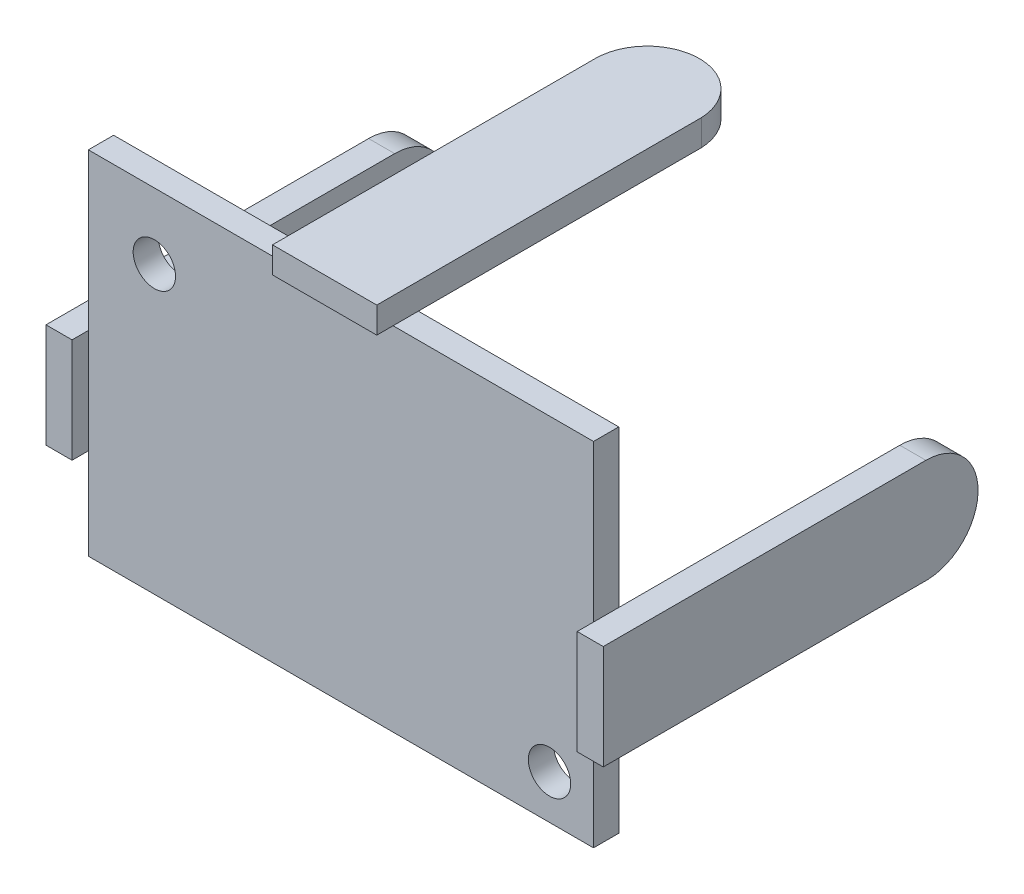
ISO-10303-21;
HEADER;
FILE_DESCRIPTION(('STEP AP214'),'2;1');
FILE_NAME('part.step','',(''),(''),'','','');
FILE_SCHEMA(('AUTOMOTIVE_DESIGN { 1 0 10303 214 1 1 1 1 }'));
ENDSEC;
DATA;
#1=APPLICATION_CONTEXT('core data for automotive mechanical design processes');
#2=APPLICATION_PROTOCOL_DEFINITION('international standard','automotive_design',2000,#1);
#3=PRODUCT_CONTEXT('',#1,'mechanical');
#4=PRODUCT('Part','Part','',(#3));
#5=PRODUCT_RELATED_PRODUCT_CATEGORY('part','',(#4));
#6=PRODUCT_DEFINITION_FORMATION('','',#4);
#7=PRODUCT_DEFINITION_CONTEXT('part definition',#1,'design');
#8=PRODUCT_DEFINITION('design','',#6,#7);
#9=PRODUCT_DEFINITION_SHAPE('','',#8);
#10=(LENGTH_UNIT() NAMED_UNIT(*) SI_UNIT(.MILLI.,.METRE.));
#11=(NAMED_UNIT(*) PLANE_ANGLE_UNIT() SI_UNIT($,.RADIAN.));
#12=(NAMED_UNIT(*) SI_UNIT($,.STERADIAN.) SOLID_ANGLE_UNIT());
#13=UNCERTAINTY_MEASURE_WITH_UNIT(LENGTH_MEASURE(1.E-05),#10,'distance_accuracy_value','');
#14=(GEOMETRIC_REPRESENTATION_CONTEXT(3) GLOBAL_UNCERTAINTY_ASSIGNED_CONTEXT((#13)) GLOBAL_UNIT_ASSIGNED_CONTEXT((#10,
#11,#12)) REPRESENTATION_CONTEXT('',''));
#15=CARTESIAN_POINT('',(0.,0.,0.));
#16=DIRECTION('',(0.,0.,1.));
#17=DIRECTION('',(1.,0.,0.));
#18=AXIS2_PLACEMENT_3D('',#15,#16,#17);
#19=CARTESIAN_POINT('',(17.1,-5.2,1.55));
#20=DIRECTION('',(0.,1.,0.));
#21=DIRECTION('',(0.,0.,1.));
#22=AXIS2_PLACEMENT_3D('',#19,#20,#21);
#23=PLANE('',#22);
#24=DIRECTION('',(0.,0.,-1.));
#25=VECTOR('',#24,1.);
#26=CARTESIAN_POINT('',(15.5,-5.2,1.55));
#27=LINE('',#26,#25);
#28=CARTESIAN_POINT('',(15.5,-5.2,2.55));
#29=VERTEX_POINT('',#28);
#30=CARTESIAN_POINT('',(15.5,-5.2,-17.364147134296));
#31=VERTEX_POINT('',#30);
#32=EDGE_CURVE('E119',#29,#31,#27,.T.);
#33=ORIENTED_EDGE('',*,*,#32,.T.);
#34=DIRECTION('',(-1.,0.,0.));
#35=VECTOR('',#34,1.);
#36=CARTESIAN_POINT('',(17.1,-5.2,-17.364147134296));
#37=LINE('',#36,#35);
#38=CARTESIAN_POINT('',(17.1,-5.2,-17.364147134296));
#39=VERTEX_POINT('',#38);
#40=EDGE_CURVE('E12',#39,#31,#37,.T.);
#41=ORIENTED_EDGE('',*,*,#40,.F.);
#42=DIRECTION('',(0.,0.,-1.));
#43=VECTOR('',#42,1.);
#44=CARTESIAN_POINT('',(17.1,-5.2,1.55));
#45=LINE('',#44,#43);
#46=CARTESIAN_POINT('',(17.1,-5.2,2.55));
#47=VERTEX_POINT('',#46);
#48=EDGE_CURVE('E98',#47,#39,#45,.T.);
#49=ORIENTED_EDGE('',*,*,#48,.F.);
#50=DIRECTION('',(-1.,0.,0.));
#51=VECTOR('',#50,1.);
#52=CARTESIAN_POINT('',(17.1,-5.2,2.55));
#53=LINE('',#52,#51);
#54=EDGE_CURVE('E118',#47,#29,#53,.T.);
#55=ORIENTED_EDGE('',*,*,#54,.T.);
#56=EDGE_LOOP('',(#33,#41,#49,#55));
#57=FACE_BOUND('',#56,.T.);
#58=ADVANCED_FACE('F56',(#57),#23,.F.);
#59=CARTESIAN_POINT('',(17.1,-2.00103650553792,-17.2489634944621));
#60=DIRECTION('',(-1.,0.,0.));
#61=DIRECTION('',(0.,0.,1.));
#62=AXIS2_PLACEMENT_3D('',#59,#60,#61);
#63=CYLINDRICAL_SURFACE('',#62,3.20103650553792);
#64=CARTESIAN_POINT('',(15.5,-2.00103650553792,-17.2489634944621));
#65=DIRECTION('',(-1.,0.,0.));
#66=DIRECTION('',(0.,-1.,0.));
#67=AXIS2_PLACEMENT_3D('',#64,#65,#66);
#68=CIRCLE('',#67,3.20103650553792);
#69=CARTESIAN_POINT('',(15.5,1.2,-17.2489634944621));
#70=VERTEX_POINT('',#69);
#71=EDGE_CURVE('E108',#70,#31,#68,.T.);
#72=ORIENTED_EDGE('',*,*,#71,.F.);
#73=DIRECTION('',(-1.,0.,0.));
#74=VECTOR('',#73,1.);
#75=CARTESIAN_POINT('',(17.1,1.2,-17.2489634944621));
#76=LINE('',#75,#74);
#77=CARTESIAN_POINT('',(17.1,1.2,-17.2489634944621));
#78=VERTEX_POINT('',#77);
#79=EDGE_CURVE('E64',#78,#70,#76,.T.);
#80=ORIENTED_EDGE('',*,*,#79,.F.);
#81=CARTESIAN_POINT('',(17.1,-2.00103650553792,-17.2489634944621));
#82=DIRECTION('',(-1.,0.,0.));
#83=DIRECTION('',(0.,-1.,0.));
#84=AXIS2_PLACEMENT_3D('',#81,#82,#83);
#85=CIRCLE('',#84,3.20103650553792);
#86=EDGE_CURVE('E106',#78,#39,#85,.T.);
#87=ORIENTED_EDGE('',*,*,#86,.T.);
#88=ORIENTED_EDGE('',*,*,#40,.T.);
#89=EDGE_LOOP('',(#72,#80,#87,#88));
#90=FACE_BOUND('',#89,.T.);
#91=ADVANCED_FACE('F105',(#90),#63,.T.);
#92=CARTESIAN_POINT('',(17.1,1.2,1.55));
#93=DIRECTION('',(0.,-1.,0.));
#94=DIRECTION('',(0.,0.,-1.));
#95=AXIS2_PLACEMENT_3D('',#92,#93,#94);
#96=PLANE('',#95);
#97=DIRECTION('',(0.,0.,1.));
#98=VECTOR('',#97,1.);
#99=CARTESIAN_POINT('',(15.5,1.2,1.55));
#100=LINE('',#99,#98);
#101=CARTESIAN_POINT('',(15.5,1.2,2.55));
#102=VERTEX_POINT('',#101);
#103=EDGE_CURVE('E87',#70,#102,#100,.T.);
#104=ORIENTED_EDGE('',*,*,#103,.T.);
#105=DIRECTION('',(-1.,0.,0.));
#106=VECTOR('',#105,1.);
#107=CARTESIAN_POINT('',(17.1,1.2,2.55));
#108=LINE('',#107,#106);
#109=CARTESIAN_POINT('',(17.1,1.2,2.55));
#110=VERTEX_POINT('',#109);
#111=EDGE_CURVE('E109',#110,#102,#108,.T.);
#112=ORIENTED_EDGE('',*,*,#111,.F.);
#113=DIRECTION('',(0.,0.,1.));
#114=VECTOR('',#113,1.);
#115=CARTESIAN_POINT('',(17.1,1.2,1.55));
#116=LINE('',#115,#114);
#117=EDGE_CURVE('E110',#78,#110,#116,.T.);
#118=ORIENTED_EDGE('',*,*,#117,.F.);
#119=ORIENTED_EDGE('',*,*,#79,.T.);
#120=EDGE_LOOP('',(#104,#112,#118,#119));
#121=FACE_BOUND('',#120,.T.);
#122=ADVANCED_FACE('F111',(#121),#96,.F.);
#123=CARTESIAN_POINT('',(17.1,10.8,2.55));
#124=DIRECTION('',(0.,0.,-1.));
#125=DIRECTION('',(0.,1.,0.));
#126=AXIS2_PLACEMENT_3D('',#123,#124,#125);
#127=PLANE('',#126);
#128=DIRECTION('',(0.,-1.,0.));
#129=VECTOR('',#128,1.);
#130=CARTESIAN_POINT('',(15.5,10.8,2.55));
#131=LINE('',#130,#129);
#132=EDGE_CURVE('E93',#102,#29,#131,.T.);
#133=ORIENTED_EDGE('',*,*,#132,.T.);
#134=ORIENTED_EDGE('',*,*,#54,.F.);
#135=DIRECTION('',(0.,-1.,0.));
#136=VECTOR('',#135,1.);
#137=CARTESIAN_POINT('',(17.1,10.8,2.55));
#138=LINE('',#137,#136);
#139=EDGE_CURVE('E72',#110,#47,#138,.T.);
#140=ORIENTED_EDGE('',*,*,#139,.F.);
#141=ORIENTED_EDGE('',*,*,#111,.T.);
#142=EDGE_LOOP('',(#133,#134,#140,#141));
#143=FACE_BOUND('',#142,.T.);
#144=ADVANCED_FACE('F126',(#143),#127,.F.);
#145=CARTESIAN_POINT('',(17.1,-2.00103650553792,-17.2489634944621));
#146=DIRECTION('',(-1.,0.,0.));
#147=DIRECTION('',(0.,-1.,0.));
#148=AXIS2_PLACEMENT_3D('',#145,#146,#147);
#149=PLANE('',#148);
#150=ORIENTED_EDGE('',*,*,#48,.T.);
#151=ORIENTED_EDGE('',*,*,#86,.F.);
#152=ORIENTED_EDGE('',*,*,#117,.T.);
#153=ORIENTED_EDGE('',*,*,#139,.T.);
#154=EDGE_LOOP('',(#150,#151,#152,#153));
#155=FACE_BOUND('',#154,.T.);
#156=ADVANCED_FACE('F113',(#155),#149,.F.);
#157=CARTESIAN_POINT('',(15.5,-2.00103650553792,-17.2489634944621));
#158=DIRECTION('',(-1.,0.,0.));
#159=DIRECTION('',(0.,-1.,0.));
#160=AXIS2_PLACEMENT_3D('',#157,#158,#159);
#161=PLANE('',#160);
#162=ORIENTED_EDGE('',*,*,#32,.F.);
#163=ORIENTED_EDGE('',*,*,#132,.F.);
#164=ORIENTED_EDGE('',*,*,#103,.F.);
#165=ORIENTED_EDGE('',*,*,#71,.T.);
#166=EDGE_LOOP('',(#162,#163,#164,#165));
#167=FACE_BOUND('',#166,.T.);
#168=ADVANCED_FACE('F129',(#167),#161,.T.);
#169=CLOSED_SHELL('',(#58,#91,#122,#144,#156,#168));
#170=MANIFOLD_SOLID_BREP('B2',#169);
#171=CARTESIAN_POINT('',(15.5,10.8,1.55));
#172=DIRECTION('',(0.,-1.,0.));
#173=DIRECTION('',(1.,0.,0.));
#174=AXIS2_PLACEMENT_3D('',#171,#172,#173);
#175=PLANE('',#174);
#176=DIRECTION('',(0.,0.,1.));
#177=VECTOR('',#176,1.);
#178=CARTESIAN_POINT('',(-3.2,10.8,2.55));
#179=LINE('',#178,#177);
#180=CARTESIAN_POINT('',(-3.2,10.8,0.));
#181=VERTEX_POINT('',#180);
#182=CARTESIAN_POINT('',(-3.2,10.8,1.55));
#183=VERTEX_POINT('',#182);
#184=EDGE_CURVE('E54',#181,#183,#179,.T.);
#185=ORIENTED_EDGE('',*,*,#184,.F.);
#186=DIRECTION('',(-1.,0.,0.));
#187=VECTOR('',#186,1.);
#188=CARTESIAN_POINT('',(15.5,10.8,0.));
#189=LINE('',#188,#187);
#190=CARTESIAN_POINT('',(-15.5,10.8,0.));
#191=VERTEX_POINT('',#190);
#192=EDGE_CURVE('E451',#181,#191,#189,.T.);
#193=ORIENTED_EDGE('',*,*,#192,.T.);
#194=DIRECTION('',(0.,0.,-1.));
#195=VECTOR('',#194,1.);
#196=CARTESIAN_POINT('',(-15.5,10.8,1.55));
#197=LINE('',#196,#195);
#198=CARTESIAN_POINT('',(-15.5,10.8,1.55));
#199=VERTEX_POINT('',#198);
#200=EDGE_CURVE('E438',#199,#191,#197,.T.);
#201=ORIENTED_EDGE('',*,*,#200,.F.);
#202=DIRECTION('',(-1.,0.,0.));
#203=VECTOR('',#202,1.);
#204=CARTESIAN_POINT('',(15.5,10.8,1.55));
#205=LINE('',#204,#203);
#206=EDGE_CURVE('E223',#183,#199,#205,.T.);
#207=ORIENTED_EDGE('',*,*,#206,.F.);
#208=EDGE_LOOP('',(#185,#193,#201,#207));
#209=FACE_BOUND('',#208,.T.);
#210=ADVANCED_FACE('F203',(#209),#175,.F.);
#211=DIRECTION('',(0.,0.,-1.));
#212=VECTOR('',#211,1.);
#213=CARTESIAN_POINT('',(3.2,10.8,2.55));
#214=LINE('',#213,#212);
#215=CARTESIAN_POINT('',(3.2,10.8,1.55));
#216=VERTEX_POINT('',#215);
#217=CARTESIAN_POINT('',(3.2,10.8,0.));
#218=VERTEX_POINT('',#217);
#219=EDGE_CURVE('E213',#216,#218,#214,.T.);
#220=ORIENTED_EDGE('',*,*,#219,.F.);
#221=CARTESIAN_POINT('',(15.5,10.8,1.55));
#222=VERTEX_POINT('',#221);
#223=EDGE_CURVE('E435',#222,#216,#205,.T.);
#224=ORIENTED_EDGE('',*,*,#223,.F.);
#225=DIRECTION('',(0.,0.,-1.));
#226=VECTOR('',#225,1.);
#227=CARTESIAN_POINT('',(15.5,10.8,1.55));
#228=LINE('',#227,#226);
#229=CARTESIAN_POINT('',(15.5,10.8,0.));
#230=VERTEX_POINT('',#229);
#231=EDGE_CURVE('E459',#222,#230,#228,.T.);
#232=ORIENTED_EDGE('',*,*,#231,.T.);
#233=EDGE_CURVE('E452',#230,#218,#189,.T.);
#234=ORIENTED_EDGE('',*,*,#233,.T.);
#235=EDGE_LOOP('',(#220,#224,#232,#234));
#236=FACE_BOUND('',#235,.T.);
#237=ADVANCED_FACE('F564',(#236),#175,.F.);
#238=CARTESIAN_POINT('',(-15.5,10.8,1.55));
#239=DIRECTION('',(1.,0.,0.));
#240=DIRECTION('',(0.,1.,0.));
#241=AXIS2_PLACEMENT_3D('',#238,#239,#240);
#242=PLANE('',#241);
#243=DIRECTION('',(0.,-1.,0.));
#244=VECTOR('',#243,1.);
#245=CARTESIAN_POINT('',(-15.5,10.8,1.55));
#246=LINE('',#245,#244);
#247=CARTESIAN_POINT('',(-15.5,-5.2,1.55));
#248=VERTEX_POINT('',#247);
#249=CARTESIAN_POINT('',(-15.5,-10.8,1.55));
#250=VERTEX_POINT('',#249);
#251=EDGE_CURVE('E429',#248,#250,#246,.T.);
#252=ORIENTED_EDGE('',*,*,#251,.F.);
#253=DIRECTION('',(0.,0.,-1.));
#254=VECTOR('',#253,1.);
#255=CARTESIAN_POINT('',(-15.5,-5.2,1.55));
#256=LINE('',#255,#254);
#257=CARTESIAN_POINT('',(-15.5,-5.2,0.));
#258=VERTEX_POINT('',#257);
#259=EDGE_CURVE('E355',#248,#258,#256,.T.);
#260=ORIENTED_EDGE('',*,*,#259,.T.);
#261=DIRECTION('',(0.,-1.,0.));
#262=VECTOR('',#261,1.);
#263=CARTESIAN_POINT('',(-15.5,10.8,0.));
#264=LINE('',#263,#262);
#265=CARTESIAN_POINT('',(-15.5,-10.8,0.));
#266=VERTEX_POINT('',#265);
#267=EDGE_CURVE('E419',#258,#266,#264,.T.);
#268=ORIENTED_EDGE('',*,*,#267,.T.);
#269=DIRECTION('',(0.,0.,-1.));
#270=VECTOR('',#269,1.);
#271=CARTESIAN_POINT('',(-15.5,-10.8,1.55));
#272=LINE('',#271,#270);
#273=EDGE_CURVE('E207',#250,#266,#272,.T.);
#274=ORIENTED_EDGE('',*,*,#273,.F.);
#275=EDGE_LOOP('',(#252,#260,#268,#274));
#276=FACE_BOUND('',#275,.T.);
#277=ADVANCED_FACE('F500',(#276),#242,.F.);
#278=CARTESIAN_POINT('',(0.,0.,1.55));
#279=DIRECTION('',(0.,0.,-1.));
#280=DIRECTION('',(-1.,0.,0.));
#281=AXIS2_PLACEMENT_3D('',#278,#279,#280);
#282=PLANE('',#281);
#283=CARTESIAN_POINT('',(-15.5,1.2,1.55));
#284=VERTEX_POINT('',#283);
#285=EDGE_CURVE('E423',#199,#284,#246,.T.);
#286=ORIENTED_EDGE('',*,*,#285,.T.);
#287=EDGE_CURVE('E428',#284,#248,#246,.T.);
#288=ORIENTED_EDGE('',*,*,#287,.T.);
#289=ORIENTED_EDGE('',*,*,#251,.T.);
#290=DIRECTION('',(1.,0.,0.));
#291=VECTOR('',#290,1.);
#292=CARTESIAN_POINT('',(15.5,-10.8,1.55));
#293=LINE('',#292,#291);
#294=CARTESIAN_POINT('',(15.5,-10.8,1.55));
#295=VERTEX_POINT('',#294);
#296=EDGE_CURVE('E427',#250,#295,#293,.T.);
#297=ORIENTED_EDGE('',*,*,#296,.T.);
#298=DIRECTION('',(0.,1.,0.));
#299=VECTOR('',#298,1.);
#300=CARTESIAN_POINT('',(15.5,10.8,1.55));
#301=LINE('',#300,#299);
#302=EDGE_CURVE('E432',#295,#222,#301,.T.);
#303=ORIENTED_EDGE('',*,*,#302,.T.);
#304=ORIENTED_EDGE('',*,*,#223,.T.);
#305=EDGE_CURVE('E439',#216,#183,#205,.T.);
#306=ORIENTED_EDGE('',*,*,#305,.T.);
#307=ORIENTED_EDGE('',*,*,#206,.T.);
#308=EDGE_LOOP('',(#286,#288,#289,#297,#303,#304,#306,#307));
#309=FACE_BOUND('',#308,.T.);
#310=CARTESIAN_POINT('',(12.8,-8.1,1.55));
#311=DIRECTION('',(0.,0.,1.));
#312=DIRECTION('',(1.,0.,0.));
#313=AXIS2_PLACEMENT_3D('',#310,#311,#312);
#314=CIRCLE('',#313,1.3);
#315=CARTESIAN_POINT('',(14.1,-8.1,1.55));
#316=VERTEX_POINT('',#315);
#317=EDGE_CURVE('E415',#316,#316,#314,.T.);
#318=ORIENTED_EDGE('',*,*,#317,.F.);
#319=EDGE_LOOP('',(#318));
#320=FACE_BOUND('',#319,.T.);
#321=CARTESIAN_POINT('',(-11.45,6.75,1.55));
#322=DIRECTION('',(0.,0.,1.));
#323=DIRECTION('',(1.,0.,0.));
#324=AXIS2_PLACEMENT_3D('',#321,#322,#323);
#325=CIRCLE('',#324,1.3);
#326=CARTESIAN_POINT('',(-10.15,6.75,1.55));
#327=VERTEX_POINT('',#326);
#328=EDGE_CURVE('E407',#327,#327,#325,.T.);
#329=ORIENTED_EDGE('',*,*,#328,.F.);
#330=EDGE_LOOP('',(#329));
#331=FACE_BOUND('',#330,.T.);
#332=ADVANCED_FACE('F504',(#309,#320,#331),#282,.F.);
#333=CARTESIAN_POINT('',(0.,0.,0.));
#334=DIRECTION('',(0.,0.,-1.));
#335=DIRECTION('',(-1.,0.,0.));
#336=AXIS2_PLACEMENT_3D('',#333,#334,#335);
#337=PLANE('',#336);
#338=CARTESIAN_POINT('',(12.8,-8.1,0.));
#339=DIRECTION('',(0.,0.,1.));
#340=DIRECTION('',(1.,0.,0.));
#341=AXIS2_PLACEMENT_3D('',#338,#339,#340);
#342=CIRCLE('',#341,1.3);
#343=CARTESIAN_POINT('',(14.1,-8.1,0.));
#344=VERTEX_POINT('',#343);
#345=EDGE_CURVE('E411',#344,#344,#342,.T.);
#346=ORIENTED_EDGE('',*,*,#345,.T.);
#347=EDGE_LOOP('',(#346));
#348=FACE_BOUND('',#347,.T.);
#349=CARTESIAN_POINT('',(-15.5,1.2,0.));
#350=VERTEX_POINT('',#349);
#351=EDGE_CURVE('E440',#191,#350,#264,.T.);
#352=ORIENTED_EDGE('',*,*,#351,.F.);
#353=ORIENTED_EDGE('',*,*,#192,.F.);
#354=EDGE_CURVE('E455',#218,#181,#189,.T.);
#355=ORIENTED_EDGE('',*,*,#354,.F.);
#356=ORIENTED_EDGE('',*,*,#233,.F.);
#357=DIRECTION('',(0.,1.,0.));
#358=VECTOR('',#357,1.);
#359=CARTESIAN_POINT('',(15.5,10.8,0.));
#360=LINE('',#359,#358);
#361=CARTESIAN_POINT('',(15.5,-10.8,0.));
#362=VERTEX_POINT('',#361);
#363=EDGE_CURVE('E448',#362,#230,#360,.T.);
#364=ORIENTED_EDGE('',*,*,#363,.F.);
#365=DIRECTION('',(1.,0.,0.));
#366=VECTOR('',#365,1.);
#367=CARTESIAN_POINT('',(15.5,-10.8,0.));
#368=LINE('',#367,#366);
#369=EDGE_CURVE('E444',#266,#362,#368,.T.);
#370=ORIENTED_EDGE('',*,*,#369,.F.);
#371=ORIENTED_EDGE('',*,*,#267,.F.);
#372=EDGE_CURVE('E445',#350,#258,#264,.T.);
#373=ORIENTED_EDGE('',*,*,#372,.F.);
#374=EDGE_LOOP('',(#352,#353,#355,#356,#364,#370,#371,#373));
#375=FACE_BOUND('',#374,.T.);
#376=CARTESIAN_POINT('',(-11.45,6.75,0.));
#377=DIRECTION('',(0.,0.,1.));
#378=DIRECTION('',(1.,0.,0.));
#379=AXIS2_PLACEMENT_3D('',#376,#377,#378);
#380=CIRCLE('',#379,1.3);
#381=CARTESIAN_POINT('',(-10.15,6.75,0.));
#382=VERTEX_POINT('',#381);
#383=EDGE_CURVE('E396',#382,#382,#380,.T.);
#384=ORIENTED_EDGE('',*,*,#383,.T.);
#385=EDGE_LOOP('',(#384));
#386=FACE_BOUND('',#385,.T.);
#387=ADVANCED_FACE('F516',(#348,#375,#386),#337,.T.);
#388=ORIENTED_EDGE('',*,*,#351,.T.);
#389=DIRECTION('',(0.,0.,1.));
#390=VECTOR('',#389,1.);
#391=CARTESIAN_POINT('',(-15.5,1.2,1.55));
#392=LINE('',#391,#390);
#393=EDGE_CURVE('E389',#350,#284,#392,.T.);
#394=ORIENTED_EDGE('',*,*,#393,.T.);
#395=ORIENTED_EDGE('',*,*,#285,.F.);
#396=ORIENTED_EDGE('',*,*,#200,.T.);
#397=EDGE_LOOP('',(#388,#394,#395,#396));
#398=FACE_BOUND('',#397,.T.);
#399=ADVANCED_FACE('F205',(#398),#242,.F.);
#400=CARTESIAN_POINT('',(15.5,-10.8,1.55));
#401=DIRECTION('',(0.,1.,0.));
#402=DIRECTION('',(-1.,0.,0.));
#403=AXIS2_PLACEMENT_3D('',#400,#401,#402);
#404=PLANE('',#403);
#405=ORIENTED_EDGE('',*,*,#369,.T.);
#406=DIRECTION('',(0.,0.,-1.));
#407=VECTOR('',#406,1.);
#408=CARTESIAN_POINT('',(15.5,-10.8,1.55));
#409=LINE('',#408,#407);
#410=EDGE_CURVE('E462',#295,#362,#409,.T.);
#411=ORIENTED_EDGE('',*,*,#410,.F.);
#412=ORIENTED_EDGE('',*,*,#296,.F.);
#413=ORIENTED_EDGE('',*,*,#273,.T.);
#414=EDGE_LOOP('',(#405,#411,#412,#413));
#415=FACE_BOUND('',#414,.T.);
#416=ADVANCED_FACE('F519',(#415),#404,.F.);
#417=CARTESIAN_POINT('',(15.5,10.8,1.55));
#418=DIRECTION('',(-1.,0.,0.));
#419=DIRECTION('',(0.,-1.,0.));
#420=AXIS2_PLACEMENT_3D('',#417,#418,#419);
#421=PLANE('',#420);
#422=ORIENTED_EDGE('',*,*,#363,.T.);
#423=ORIENTED_EDGE('',*,*,#231,.F.);
#424=ORIENTED_EDGE('',*,*,#302,.F.);
#425=ORIENTED_EDGE('',*,*,#410,.T.);
#426=EDGE_LOOP('',(#422,#423,#424,#425));
#427=FACE_BOUND('',#426,.T.);
#428=ADVANCED_FACE('F521',(#427),#421,.F.);
#429=CARTESIAN_POINT('',(12.8,-8.1,1.55));
#430=DIRECTION('',(0.,0.,-1.));
#431=DIRECTION('',(-1.,0.,0.));
#432=AXIS2_PLACEMENT_3D('',#429,#430,#431);
#433=CYLINDRICAL_SURFACE('',#432,1.3);
#434=ORIENTED_EDGE('',*,*,#317,.T.);
#435=EDGE_LOOP('',(#434));
#436=FACE_BOUND('',#435,.T.);
#437=ORIENTED_EDGE('',*,*,#345,.F.);
#438=EDGE_LOOP('',(#437));
#439=FACE_BOUND('',#438,.T.);
#440=ADVANCED_FACE('F573',(#436,#439),#433,.F.);
#441=CARTESIAN_POINT('',(-11.45,6.75,1.55));
#442=DIRECTION('',(0.,0.,-1.));
#443=DIRECTION('',(-1.,0.,0.));
#444=AXIS2_PLACEMENT_3D('',#441,#442,#443);
#445=CYLINDRICAL_SURFACE('',#444,1.3);
#446=ORIENTED_EDGE('',*,*,#328,.T.);
#447=EDGE_LOOP('',(#446));
#448=FACE_BOUND('',#447,.T.);
#449=ORIENTED_EDGE('',*,*,#383,.F.);
#450=EDGE_LOOP('',(#449));
#451=FACE_BOUND('',#450,.T.);
#452=ADVANCED_FACE('F577',(#448,#451),#445,.F.);
#453=CARTESIAN_POINT('',(-15.5,-2.00103650553792,-17.2489634944621));
#454=DIRECTION('',(1.,0.,0.));
#455=DIRECTION('',(0.,1.,0.));
#456=AXIS2_PLACEMENT_3D('',#453,#454,#455);
#457=PLANE('',#456);
#458=ORIENTED_EDGE('',*,*,#287,.F.);
#459=CARTESIAN_POINT('',(-15.5,1.2,2.55));
#460=VERTEX_POINT('',#459);
#461=EDGE_CURVE('E384',#284,#460,#392,.T.);
#462=ORIENTED_EDGE('',*,*,#461,.T.);
#463=DIRECTION('',(0.,-1.,0.));
#464=VECTOR('',#463,1.);
#465=CARTESIAN_POINT('',(-15.5,10.8,2.55));
#466=LINE('',#465,#464);
#467=CARTESIAN_POINT('',(-15.5,-5.2,2.55));
#468=VERTEX_POINT('',#467);
#469=EDGE_CURVE('E365',#460,#468,#466,.T.);
#470=ORIENTED_EDGE('',*,*,#469,.T.);
#471=EDGE_CURVE('E353',#468,#248,#256,.T.);
#472=ORIENTED_EDGE('',*,*,#471,.T.);
#473=EDGE_LOOP('',(#458,#462,#470,#472));
#474=FACE_BOUND('',#473,.T.);
#475=ADVANCED_FACE('F483',(#474),#457,.T.);
#476=CARTESIAN_POINT('',(-17.1,-5.2,1.55));
#477=DIRECTION('',(0.,-1.,0.));
#478=DIRECTION('',(0.,0.,-1.));
#479=AXIS2_PLACEMENT_3D('',#476,#477,#478);
#480=PLANE('',#479);
#481=ORIENTED_EDGE('',*,*,#471,.F.);
#482=DIRECTION('',(1.,0.,0.));
#483=VECTOR('',#482,1.);
#484=CARTESIAN_POINT('',(-17.1,-5.2,2.55));
#485=LINE('',#484,#483);
#486=CARTESIAN_POINT('',(-17.1,-5.2,2.55));
#487=VERTEX_POINT('',#486);
#488=EDGE_CURVE('E393',#487,#468,#485,.T.);
#489=ORIENTED_EDGE('',*,*,#488,.F.);
#490=DIRECTION('',(0.,0.,-1.));
#491=VECTOR('',#490,1.);
#492=CARTESIAN_POINT('',(-17.1,-5.2,1.55));
#493=LINE('',#492,#491);
#494=CARTESIAN_POINT('',(-17.1,-5.2,-17.364147134296));
#495=VERTEX_POINT('',#494);
#496=EDGE_CURVE('E360',#487,#495,#493,.T.);
#497=ORIENTED_EDGE('',*,*,#496,.T.);
#498=DIRECTION('',(1.,0.,0.));
#499=VECTOR('',#498,1.);
#500=CARTESIAN_POINT('',(-17.1,-5.2,-17.364147134296));
#501=LINE('',#500,#499);
#502=CARTESIAN_POINT('',(-15.5,-5.2,-17.364147134296));
#503=VERTEX_POINT('',#502);
#504=EDGE_CURVE('E376',#495,#503,#501,.T.);
#505=ORIENTED_EDGE('',*,*,#504,.T.);
#506=EDGE_CURVE('E349',#258,#503,#256,.T.);
#507=ORIENTED_EDGE('',*,*,#506,.F.);
#508=ORIENTED_EDGE('',*,*,#259,.F.);
#509=EDGE_LOOP('',(#481,#489,#497,#505,#507,#508));
#510=FACE_BOUND('',#509,.T.);
#511=ADVANCED_FACE('F496',(#510),#480,.T.);
#512=CARTESIAN_POINT('',(-17.1,10.8,2.55));
#513=DIRECTION('',(0.,0.,1.));
#514=DIRECTION('',(0.,-1.,0.));
#515=AXIS2_PLACEMENT_3D('',#512,#513,#514);
#516=PLANE('',#515);
#517=ORIENTED_EDGE('',*,*,#469,.F.);
#518=DIRECTION('',(1.,0.,0.));
#519=VECTOR('',#518,1.);
#520=CARTESIAN_POINT('',(-17.1,1.2,2.55));
#521=LINE('',#520,#519);
#522=CARTESIAN_POINT('',(-17.1,1.2,2.55));
#523=VERTEX_POINT('',#522);
#524=EDGE_CURVE('E397',#523,#460,#521,.T.);
#525=ORIENTED_EDGE('',*,*,#524,.F.);
#526=DIRECTION('',(0.,-1.,0.));
#527=VECTOR('',#526,1.);
#528=CARTESIAN_POINT('',(-17.1,10.8,2.55));
#529=LINE('',#528,#527);
#530=EDGE_CURVE('E373',#523,#487,#529,.T.);
#531=ORIENTED_EDGE('',*,*,#530,.T.);
#532=ORIENTED_EDGE('',*,*,#488,.T.);
#533=EDGE_LOOP('',(#517,#525,#531,#532));
#534=FACE_BOUND('',#533,.T.);
#535=ADVANCED_FACE('F492',(#534),#516,.T.);
#536=CARTESIAN_POINT('',(-17.1,1.2,1.55));
#537=DIRECTION('',(0.,1.,0.));
#538=DIRECTION('',(0.,0.,1.));
#539=AXIS2_PLACEMENT_3D('',#536,#537,#538);
#540=PLANE('',#539);
#541=CARTESIAN_POINT('',(-15.5,1.2,-17.2489634944621));
#542=VERTEX_POINT('',#541);
#543=EDGE_CURVE('E385',#542,#350,#392,.T.);
#544=ORIENTED_EDGE('',*,*,#543,.F.);
#545=DIRECTION('',(1.,0.,0.));
#546=VECTOR('',#545,1.);
#547=CARTESIAN_POINT('',(-17.1,1.2,-17.2489634944621));
#548=LINE('',#547,#546);
#549=CARTESIAN_POINT('',(-17.1,1.2,-17.2489634944621));
#550=VERTEX_POINT('',#549);
#551=EDGE_CURVE('E401',#550,#542,#548,.T.);
#552=ORIENTED_EDGE('',*,*,#551,.F.);
#553=DIRECTION('',(0.,0.,1.));
#554=VECTOR('',#553,1.);
#555=CARTESIAN_POINT('',(-17.1,1.2,1.55));
#556=LINE('',#555,#554);
#557=EDGE_CURVE('E369',#550,#523,#556,.T.);
#558=ORIENTED_EDGE('',*,*,#557,.T.);
#559=ORIENTED_EDGE('',*,*,#524,.T.);
#560=ORIENTED_EDGE('',*,*,#461,.F.);
#561=ORIENTED_EDGE('',*,*,#393,.F.);
#562=EDGE_LOOP('',(#544,#552,#558,#559,#560,#561));
#563=FACE_BOUND('',#562,.T.);
#564=ADVANCED_FACE('F488',(#563),#540,.T.);
#565=CARTESIAN_POINT('',(-17.1,-2.00103650553792,-17.2489634944621));
#566=DIRECTION('',(1.,0.,0.));
#567=DIRECTION('',(0.,0.,-1.));
#568=AXIS2_PLACEMENT_3D('',#565,#566,#567);
#569=CYLINDRICAL_SURFACE('',#568,3.20103650553792);
#570=CARTESIAN_POINT('',(-15.5,-2.00103650553792,-17.2489634944621));
#571=DIRECTION('',(1.,0.,0.));
#572=DIRECTION('',(0.,1.,0.));
#573=AXIS2_PLACEMENT_3D('',#570,#571,#572);
#574=CIRCLE('',#573,3.20103650553792);
#575=EDGE_CURVE('E380',#503,#542,#574,.T.);
#576=ORIENTED_EDGE('',*,*,#575,.F.);
#577=ORIENTED_EDGE('',*,*,#504,.F.);
#578=CARTESIAN_POINT('',(-17.1,-2.00103650553792,-17.2489634944621));
#579=DIRECTION('',(1.,0.,0.));
#580=DIRECTION('',(0.,1.,0.));
#581=AXIS2_PLACEMENT_3D('',#578,#579,#580);
#582=CIRCLE('',#581,3.20103650553792);
#583=EDGE_CURVE('E364',#495,#550,#582,.T.);
#584=ORIENTED_EDGE('',*,*,#583,.T.);
#585=ORIENTED_EDGE('',*,*,#551,.T.);
#586=EDGE_LOOP('',(#576,#577,#584,#585));
#587=FACE_BOUND('',#586,.T.);
#588=ADVANCED_FACE('F655',(#587),#569,.T.);
#589=CARTESIAN_POINT('',(-17.1,-2.00103650553792,-17.2489634944621));
#590=DIRECTION('',(1.,0.,0.));
#591=DIRECTION('',(0.,1.,0.));
#592=AXIS2_PLACEMENT_3D('',#589,#590,#591);
#593=PLANE('',#592);
#594=ORIENTED_EDGE('',*,*,#496,.F.);
#595=ORIENTED_EDGE('',*,*,#530,.F.);
#596=ORIENTED_EDGE('',*,*,#557,.F.);
#597=ORIENTED_EDGE('',*,*,#583,.F.);
#598=EDGE_LOOP('',(#594,#595,#596,#597));
#599=FACE_BOUND('',#598,.T.);
#600=ADVANCED_FACE('F664',(#599),#593,.F.);
#601=ORIENTED_EDGE('',*,*,#543,.T.);
#602=ORIENTED_EDGE('',*,*,#372,.T.);
#603=ORIENTED_EDGE('',*,*,#506,.T.);
#604=ORIENTED_EDGE('',*,*,#575,.T.);
#605=EDGE_LOOP('',(#601,#602,#603,#604));
#606=FACE_BOUND('',#605,.T.);
#607=ADVANCED_FACE('F632',(#606),#457,.T.);
#608=CARTESIAN_POINT('',(0.00103650553792742,10.8,-17.2489634944621));
#609=DIRECTION('',(0.,-1.,0.));
#610=DIRECTION('',(1.,0.,0.));
#611=AXIS2_PLACEMENT_3D('',#608,#609,#610);
#612=PLANE('',#611);
#613=ORIENTED_EDGE('',*,*,#305,.F.);
#614=CARTESIAN_POINT('',(3.2,10.8,2.55));
#615=VERTEX_POINT('',#614);
#616=EDGE_CURVE('E526',#615,#216,#214,.T.);
#617=ORIENTED_EDGE('',*,*,#616,.F.);
#618=DIRECTION('',(1.,0.,0.));
#619=VECTOR('',#618,1.);
#620=CARTESIAN_POINT('',(-3.2,10.8,2.55));
#621=LINE('',#620,#619);
#622=CARTESIAN_POINT('',(-3.2,10.8,2.55));
#623=VERTEX_POINT('',#622);
#624=EDGE_CURVE('E347',#623,#615,#621,.T.);
#625=ORIENTED_EDGE('',*,*,#624,.F.);
#626=EDGE_CURVE('E216',#183,#623,#179,.T.);
#627=ORIENTED_EDGE('',*,*,#626,.F.);
#628=EDGE_LOOP('',(#613,#617,#625,#627));
#629=FACE_BOUND('',#628,.T.);
#630=ADVANCED_FACE('F525',(#629),#612,.T.);
#631=CARTESIAN_POINT('',(-3.2,12.4,2.55));
#632=DIRECTION('',(0.,0.,-1.));
#633=DIRECTION('',(-1.,0.,0.));
#634=AXIS2_PLACEMENT_3D('',#631,#632,#633);
#635=PLANE('',#634);
#636=ORIENTED_EDGE('',*,*,#624,.T.);
#637=DIRECTION('',(0.,-1.,0.));
#638=VECTOR('',#637,1.);
#639=CARTESIAN_POINT('',(3.2,12.4,2.55));
#640=LINE('',#639,#638);
#641=CARTESIAN_POINT('',(3.2,12.4,2.55));
#642=VERTEX_POINT('',#641);
#643=EDGE_CURVE('E326',#642,#615,#640,.T.);
#644=ORIENTED_EDGE('',*,*,#643,.F.);
#645=DIRECTION('',(1.,0.,0.));
#646=VECTOR('',#645,1.);
#647=CARTESIAN_POINT('',(-3.2,12.4,2.55));
#648=LINE('',#647,#646);
#649=CARTESIAN_POINT('',(-3.2,12.4,2.55));
#650=VERTEX_POINT('',#649);
#651=EDGE_CURVE('E334',#650,#642,#648,.T.);
#652=ORIENTED_EDGE('',*,*,#651,.F.);
#653=DIRECTION('',(0.,-1.,0.));
#654=VECTOR('',#653,1.);
#655=CARTESIAN_POINT('',(-3.2,12.4,2.55));
#656=LINE('',#655,#654);
#657=EDGE_CURVE('E541',#650,#623,#656,.T.);
#658=ORIENTED_EDGE('',*,*,#657,.T.);
#659=EDGE_LOOP('',(#636,#644,#652,#658));
#660=FACE_BOUND('',#659,.T.);
#661=ADVANCED_FACE('F345',(#660),#635,.F.);
#662=CARTESIAN_POINT('',(3.2,12.4,2.55));
#663=DIRECTION('',(-1.,0.,0.));
#664=DIRECTION('',(0.,0.,1.));
#665=AXIS2_PLACEMENT_3D('',#662,#663,#664);
#666=PLANE('',#665);
#667=ORIENTED_EDGE('',*,*,#616,.T.);
#668=ORIENTED_EDGE('',*,*,#219,.T.);
#669=CARTESIAN_POINT('',(3.19999999999999,10.8,-17.3641471342964));
#670=VERTEX_POINT('',#669);
#671=EDGE_CURVE('E530',#218,#670,#214,.T.);
#672=ORIENTED_EDGE('',*,*,#671,.T.);
#673=DIRECTION('',(0.,-1.,0.));
#674=VECTOR('',#673,1.);
#675=CARTESIAN_POINT('',(3.19999999999999,12.4,-17.3641471342964));
#676=LINE('',#675,#674);
#677=CARTESIAN_POINT('',(3.19999999999999,12.4,-17.3641471342964));
#678=VERTEX_POINT('',#677);
#679=EDGE_CURVE('E329',#678,#670,#676,.T.);
#680=ORIENTED_EDGE('',*,*,#679,.F.);
#681=DIRECTION('',(0.,0.,-1.));
#682=VECTOR('',#681,1.);
#683=CARTESIAN_POINT('',(3.2,12.4,2.55));
#684=LINE('',#683,#682);
#685=EDGE_CURVE('E321',#642,#678,#684,.T.);
#686=ORIENTED_EDGE('',*,*,#685,.F.);
#687=ORIENTED_EDGE('',*,*,#643,.T.);
#688=EDGE_LOOP('',(#667,#668,#672,#680,#686,#687));
#689=FACE_BOUND('',#688,.T.);
#690=ADVANCED_FACE('F324',(#689),#666,.F.);
#691=CARTESIAN_POINT('',(0.00103650553792724,12.4,-17.2489634944621));
#692=DIRECTION('',(0.,-1.,0.));
#693=DIRECTION('',(1.,0.,0.));
#694=AXIS2_PLACEMENT_3D('',#691,#692,#693);
#695=CYLINDRICAL_SURFACE('',#694,3.20103650553792);
#696=CARTESIAN_POINT('',(0.00103650553792742,10.8,-17.2489634944621));
#697=DIRECTION('',(0.,1.,0.));
#698=DIRECTION('',(1.,0.,0.));
#699=AXIS2_PLACEMENT_3D('',#696,#697,#698);
#700=CIRCLE('',#699,3.20103650553792);
#701=CARTESIAN_POINT('',(-3.2,10.8,-17.2489634944621));
#702=VERTEX_POINT('',#701);
#703=EDGE_CURVE('E529',#670,#702,#700,.T.);
#704=ORIENTED_EDGE('',*,*,#703,.T.);
#705=DIRECTION('',(0.,-1.,0.));
#706=VECTOR('',#705,1.);
#707=CARTESIAN_POINT('',(-3.2,12.4,-17.2489634944621));
#708=LINE('',#707,#706);
#709=CARTESIAN_POINT('',(-3.2,12.4,-17.2489634944621));
#710=VERTEX_POINT('',#709);
#711=EDGE_CURVE('E356',#710,#702,#708,.T.);
#712=ORIENTED_EDGE('',*,*,#711,.F.);
#713=CARTESIAN_POINT('',(0.00103650553792724,12.4,-17.2489634944621));
#714=DIRECTION('',(0.,1.,0.));
#715=DIRECTION('',(1.,0.,0.));
#716=AXIS2_PLACEMENT_3D('',#713,#714,#715);
#717=CIRCLE('',#716,3.20103650553792);
#718=EDGE_CURVE('E333',#678,#710,#717,.T.);
#719=ORIENTED_EDGE('',*,*,#718,.F.);
#720=ORIENTED_EDGE('',*,*,#679,.T.);
#721=EDGE_LOOP('',(#704,#712,#719,#720));
#722=FACE_BOUND('',#721,.T.);
#723=ADVANCED_FACE('F707',(#722),#695,.T.);
#724=CARTESIAN_POINT('',(-3.2,12.4,2.55));
#725=DIRECTION('',(1.,0.,0.));
#726=DIRECTION('',(0.,0.,-1.));
#727=AXIS2_PLACEMENT_3D('',#724,#725,#726);
#728=PLANE('',#727);
#729=EDGE_CURVE('E215',#702,#181,#179,.T.);
#730=ORIENTED_EDGE('',*,*,#729,.T.);
#731=ORIENTED_EDGE('',*,*,#184,.T.);
#732=ORIENTED_EDGE('',*,*,#626,.T.);
#733=ORIENTED_EDGE('',*,*,#657,.F.);
#734=DIRECTION('',(0.,0.,1.));
#735=VECTOR('',#734,1.);
#736=CARTESIAN_POINT('',(-3.2,12.4,2.55));
#737=LINE('',#736,#735);
#738=EDGE_CURVE('E339',#710,#650,#737,.T.);
#739=ORIENTED_EDGE('',*,*,#738,.F.);
#740=ORIENTED_EDGE('',*,*,#711,.T.);
#741=EDGE_LOOP('',(#730,#731,#732,#733,#739,#740));
#742=FACE_BOUND('',#741,.T.);
#743=ADVANCED_FACE('F548',(#742),#728,.F.);
#744=CARTESIAN_POINT('',(0.00103650553792724,12.4,-17.2489634944621));
#745=DIRECTION('',(0.,-1.,0.));
#746=DIRECTION('',(1.,0.,0.));
#747=AXIS2_PLACEMENT_3D('',#744,#745,#746);
#748=PLANE('',#747);
#749=ORIENTED_EDGE('',*,*,#651,.T.);
#750=ORIENTED_EDGE('',*,*,#685,.T.);
#751=ORIENTED_EDGE('',*,*,#718,.T.);
#752=ORIENTED_EDGE('',*,*,#738,.T.);
#753=EDGE_LOOP('',(#749,#750,#751,#752));
#754=FACE_BOUND('',#753,.T.);
#755=ADVANCED_FACE('F337',(#754),#748,.F.);
#756=ORIENTED_EDGE('',*,*,#671,.F.);
#757=ORIENTED_EDGE('',*,*,#354,.T.);
#758=ORIENTED_EDGE('',*,*,#729,.F.);
#759=ORIENTED_EDGE('',*,*,#703,.F.);
#760=EDGE_LOOP('',(#756,#757,#758,#759));
#761=FACE_BOUND('',#760,.T.);
#762=ADVANCED_FACE('F553',(#761),#612,.T.);
#763=CLOSED_SHELL('',(#210,#237,#277,#332,#387,#399,#416,#428,#440,#452,#475,#511,#535,#564,
#588,#600,#607,#630,#661,#690,#723,#743,#755,#762));
#764=MANIFOLD_SOLID_BREP('B6',#763);
#765=ADVANCED_BREP_SHAPE_REPRESENTATION('',(#18,#170,#764),#14);
#766=SHAPE_DEFINITION_REPRESENTATION(#9,#765);
ENDSEC;
END-ISO-10303-21;
